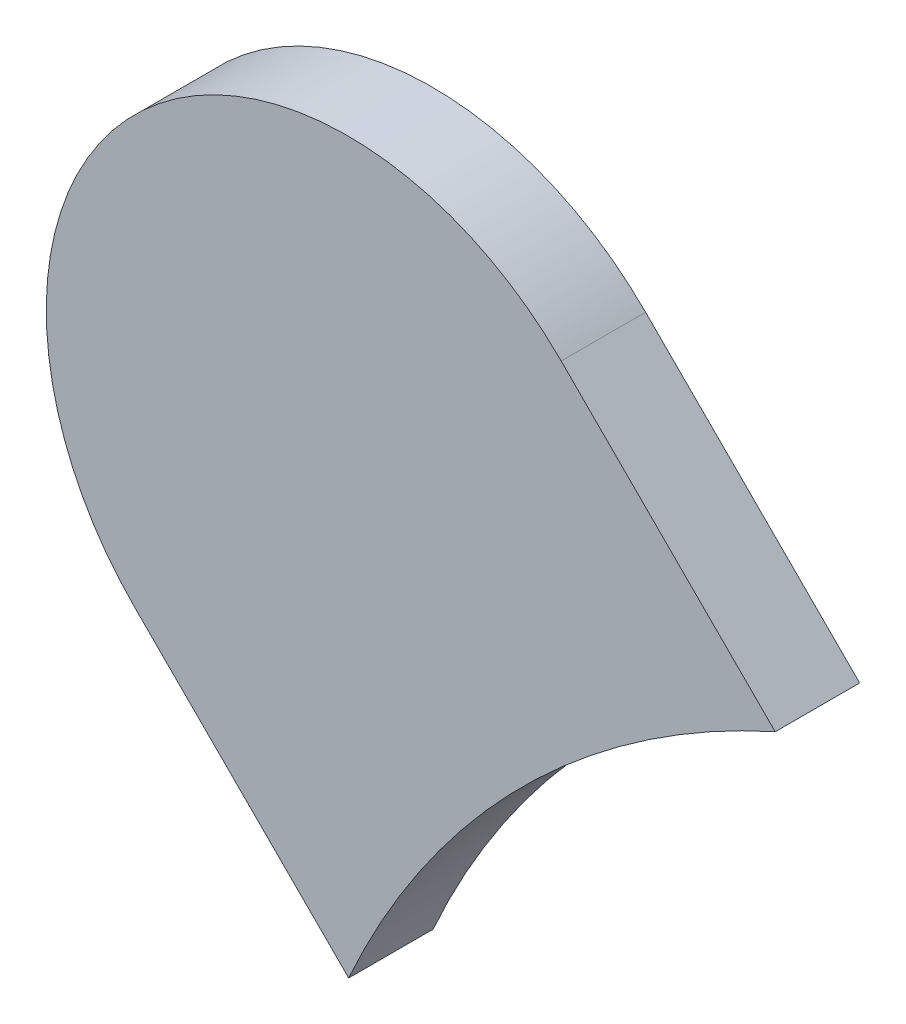
ISO-10303-21;
HEADER;
FILE_DESCRIPTION(('STEP AP214'),'2;1');
FILE_NAME('part.step','',(''),(''),'','','');
FILE_SCHEMA(('AUTOMOTIVE_DESIGN { 1 0 10303 214 1 1 1 1 }'));
ENDSEC;
DATA;
#1=APPLICATION_CONTEXT('core data for automotive mechanical design processes');
#2=APPLICATION_PROTOCOL_DEFINITION('international standard','automotive_design',2000,#1);
#3=PRODUCT_CONTEXT('',#1,'mechanical');
#4=PRODUCT('Part','Part','',(#3));
#5=PRODUCT_RELATED_PRODUCT_CATEGORY('part','',(#4));
#6=PRODUCT_DEFINITION_FORMATION('','',#4);
#7=PRODUCT_DEFINITION_CONTEXT('part definition',#1,'design');
#8=PRODUCT_DEFINITION('design','',#6,#7);
#9=PRODUCT_DEFINITION_SHAPE('','',#8);
#10=(LENGTH_UNIT() NAMED_UNIT(*) SI_UNIT(.MILLI.,.METRE.));
#11=(NAMED_UNIT(*) PLANE_ANGLE_UNIT() SI_UNIT($,.RADIAN.));
#12=(NAMED_UNIT(*) SI_UNIT($,.STERADIAN.) SOLID_ANGLE_UNIT());
#13=UNCERTAINTY_MEASURE_WITH_UNIT(LENGTH_MEASURE(1.E-05),#10,'distance_accuracy_value','');
#14=(GEOMETRIC_REPRESENTATION_CONTEXT(3) GLOBAL_UNCERTAINTY_ASSIGNED_CONTEXT((#13)) GLOBAL_UNIT_ASSIGNED_CONTEXT((#10,
#11,#12)) REPRESENTATION_CONTEXT('',''));
#15=CARTESIAN_POINT('',(0.,0.,0.));
#16=DIRECTION('',(0.,0.,1.));
#17=DIRECTION('',(1.,0.,0.));
#18=AXIS2_PLACEMENT_3D('',#15,#16,#17);
#19=CARTESIAN_POINT('',(88.20217056,73.82216884,0.));
#20=DIRECTION('',(0.707106781186563,0.707106781186532,0.));
#21=DIRECTION('',(0.707106781186532,-0.707106781186563,0.));
#22=AXIS2_PLACEMENT_3D('',#19,#20,#21);
#23=PLANE('',#22);
#24=DIRECTION('',(0.707106781186532,-0.707106781186563,0.));
#25=VECTOR('',#24,1.);
#26=CARTESIAN_POINT('',(88.20217056,73.82216884,0.03556));
#27=LINE('',#26,#25);
#28=CARTESIAN_POINT('',(88.20217056,73.82216884,0.03556));
#29=VERTEX_POINT('',#28);
#30=CARTESIAN_POINT('',(88.2923058927918,73.7320335072082,0.03556));
#31=VERTEX_POINT('',#30);
#32=EDGE_CURVE('E11',#29,#31,#27,.T.);
#33=ORIENTED_EDGE('',*,*,#32,.F.);
#34=DIRECTION('',(0.,0.,1.));
#35=VECTOR('',#34,1.);
#36=CARTESIAN_POINT('',(88.20217056,73.82216884,0.));
#37=LINE('',#36,#35);
#38=CARTESIAN_POINT('',(88.20217056,73.82216884,0.));
#39=VERTEX_POINT('',#38);
#40=EDGE_CURVE('E24',#39,#29,#37,.T.);
#41=ORIENTED_EDGE('',*,*,#40,.F.);
#42=DIRECTION('',(0.707106781186532,-0.707106781186563,0.));
#43=VECTOR('',#42,1.);
#44=CARTESIAN_POINT('',(88.20217056,73.82216884,0.));
#45=LINE('',#44,#43);
#46=CARTESIAN_POINT('',(88.2923058927918,73.7320335072082,0.));
#47=VERTEX_POINT('',#46);
#48=EDGE_CURVE('E75',#39,#47,#45,.T.);
#49=ORIENTED_EDGE('',*,*,#48,.T.);
#50=DIRECTION('',(0.,0.,1.));
#51=VECTOR('',#50,1.);
#52=CARTESIAN_POINT('',(88.2923058927918,73.7320335072082,0.));
#53=LINE('',#52,#51);
#54=EDGE_CURVE('E37',#47,#31,#53,.T.);
#55=ORIENTED_EDGE('',*,*,#54,.T.);
#56=EDGE_LOOP('',(#33,#41,#49,#55));
#57=FACE_BOUND('',#56,.T.);
#58=ADVANCED_FACE('F17',(#57),#23,.F.);
#59=CARTESIAN_POINT('',(88.61697288,73.58697246,0.));
#60=DIRECTION('',(0.,0.,-1.));
#61=DIRECTION('',(1.,0.,0.));
#62=AXIS2_PLACEMENT_3D('',#59,#60,#61);
#63=CYLINDRICAL_SURFACE('',#62,0.3556);
#64=DIRECTION('',(0.,0.,1.));
#65=VECTOR('',#64,1.);
#66=CARTESIAN_POINT('',(88.4719118327918,73.9116394472082,0.));
#67=LINE('',#66,#65);
#68=CARTESIAN_POINT('',(88.4719118327918,73.9116394472082,0.));
#69=VERTEX_POINT('',#68);
#70=CARTESIAN_POINT('',(88.4719118327918,73.9116394472082,0.03556));
#71=VERTEX_POINT('',#70);
#72=EDGE_CURVE('E67',#69,#71,#67,.T.);
#73=ORIENTED_EDGE('',*,*,#72,.T.);
#74=CARTESIAN_POINT('',(88.61697288,73.58697246,0.03556));
#75=DIRECTION('',(0.,0.,1.));
#76=DIRECTION('',(1.,0.,0.));
#77=AXIS2_PLACEMENT_3D('',#74,#75,#76);
#78=CIRCLE('',#77,0.3556);
#79=EDGE_CURVE('E82',#71,#31,#78,.T.);
#80=ORIENTED_EDGE('',*,*,#79,.T.);
#81=ORIENTED_EDGE('',*,*,#54,.F.);
#82=CARTESIAN_POINT('',(88.61697288,73.58697246,0.));
#83=DIRECTION('',(0.,0.,1.));
#84=DIRECTION('',(1.,0.,0.));
#85=AXIS2_PLACEMENT_3D('',#82,#83,#84);
#86=CIRCLE('',#85,0.3556);
#87=EDGE_CURVE('E80',#69,#47,#86,.T.);
#88=ORIENTED_EDGE('',*,*,#87,.F.);
#89=EDGE_LOOP('',(#73,#80,#81,#88));
#90=FACE_BOUND('',#89,.T.);
#91=ADVANCED_FACE('F88',(#90),#63,.F.);
#92=CARTESIAN_POINT('',(88.4719118327918,73.9116394472082,0.));
#93=DIRECTION('',(-0.707106781186563,-0.707106781186532,0.));
#94=DIRECTION('',(-0.707106781186532,0.707106781186563,0.));
#95=AXIS2_PLACEMENT_3D('',#92,#93,#94);
#96=PLANE('',#95);
#97=DIRECTION('',(-0.707106781186532,0.707106781186563,0.));
#98=VECTOR('',#97,1.);
#99=CARTESIAN_POINT('',(88.70677712,73.67677416,0.03556));
#100=LINE('',#99,#98);
#101=CARTESIAN_POINT('',(88.3817765,74.00177478,0.03556));
#102=VERTEX_POINT('',#101);
#103=EDGE_CURVE('E71',#71,#102,#100,.T.);
#104=ORIENTED_EDGE('',*,*,#103,.F.);
#105=ORIENTED_EDGE('',*,*,#72,.F.);
#106=DIRECTION('',(-0.707106781186532,0.707106781186563,0.));
#107=VECTOR('',#106,1.);
#108=CARTESIAN_POINT('',(88.70677712,73.67677416,0.));
#109=LINE('',#108,#107);
#110=CARTESIAN_POINT('',(88.3817765,74.00177478,0.));
#111=VERTEX_POINT('',#110);
#112=EDGE_CURVE('E63',#69,#111,#109,.T.);
#113=ORIENTED_EDGE('',*,*,#112,.T.);
#114=DIRECTION('',(0.,0.,1.));
#115=VECTOR('',#114,1.);
#116=CARTESIAN_POINT('',(88.3817765,74.00177478,0.));
#117=LINE('',#116,#115);
#118=EDGE_CURVE('E53',#111,#102,#117,.T.);
#119=ORIENTED_EDGE('',*,*,#118,.T.);
#120=EDGE_LOOP('',(#104,#105,#113,#119));
#121=FACE_BOUND('',#120,.T.);
#122=ADVANCED_FACE('F66',(#121),#96,.F.);
#123=CARTESIAN_POINT('',(88.29197353,73.91197181,0.));
#124=DIRECTION('',(0.,0.,-1.));
#125=DIRECTION('',(0.707106781186548,0.707106781186548,0.));
#126=AXIS2_PLACEMENT_3D('',#123,#124,#125);
#127=CYLINDRICAL_SURFACE('',#126,0.127000578115386);
#128=CARTESIAN_POINT('',(88.29197353,73.91197181,0.03556));
#129=DIRECTION('',(0.,0.,1.));
#130=DIRECTION('',(0.707106781186548,0.707106781186548,0.));
#131=AXIS2_PLACEMENT_3D('',#128,#129,#130);
#132=CIRCLE('',#131,0.127000578115386);
#133=EDGE_CURVE('E59',#102,#29,#132,.T.);
#134=ORIENTED_EDGE('',*,*,#133,.F.);
#135=ORIENTED_EDGE('',*,*,#118,.F.);
#136=CARTESIAN_POINT('',(88.29197353,73.91197181,0.));
#137=DIRECTION('',(0.,0.,1.));
#138=DIRECTION('',(0.707106781186548,0.707106781186548,0.));
#139=AXIS2_PLACEMENT_3D('',#136,#137,#138);
#140=CIRCLE('',#139,0.127000578115386);
#141=EDGE_CURVE('E57',#111,#39,#140,.T.);
#142=ORIENTED_EDGE('',*,*,#141,.T.);
#143=ORIENTED_EDGE('',*,*,#40,.T.);
#144=EDGE_LOOP('',(#134,#135,#142,#143));
#145=FACE_BOUND('',#144,.T.);
#146=ADVANCED_FACE('F55',(#145),#127,.T.);
#147=CARTESIAN_POINT('',(88.20217056,73.82216884,0.));
#148=DIRECTION('',(0.,0.,-1.));
#149=DIRECTION('',(-1.,0.,0.));
#150=AXIS2_PLACEMENT_3D('',#147,#148,#149);
#151=PLANE('',#150);
#152=ORIENTED_EDGE('',*,*,#48,.F.);
#153=ORIENTED_EDGE('',*,*,#141,.F.);
#154=ORIENTED_EDGE('',*,*,#112,.F.);
#155=ORIENTED_EDGE('',*,*,#87,.T.);
#156=EDGE_LOOP('',(#152,#153,#154,#155));
#157=FACE_BOUND('',#156,.T.);
#158=ADVANCED_FACE('F74',(#157),#151,.T.);
#159=CARTESIAN_POINT('',(88.20217056,73.82216884,0.03556));
#160=DIRECTION('',(0.,0.,-1.));
#161=DIRECTION('',(-1.,0.,0.));
#162=AXIS2_PLACEMENT_3D('',#159,#160,#161);
#163=PLANE('',#162);
#164=ORIENTED_EDGE('',*,*,#133,.T.);
#165=ORIENTED_EDGE('',*,*,#32,.T.);
#166=ORIENTED_EDGE('',*,*,#79,.F.);
#167=ORIENTED_EDGE('',*,*,#103,.T.);
#168=EDGE_LOOP('',(#164,#165,#166,#167));
#169=FACE_BOUND('',#168,.T.);
#170=ADVANCED_FACE('F91',(#169),#163,.F.);
#171=CLOSED_SHELL('',(#58,#91,#122,#146,#158,#170));
#172=MANIFOLD_SOLID_BREP('B1',#171);
#173=ADVANCED_BREP_SHAPE_REPRESENTATION('',(#18,#172),#14);
#174=SHAPE_DEFINITION_REPRESENTATION(#9,#173);
ENDSEC;
END-ISO-10303-21;
